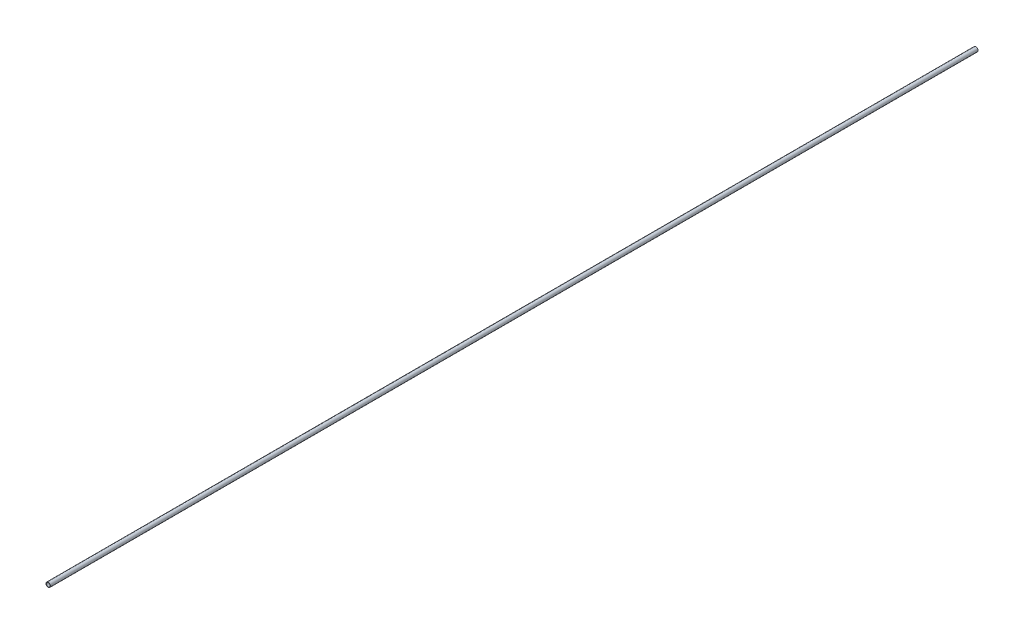
ISO-10303-21;
HEADER;
FILE_DESCRIPTION(('STEP AP214'),'2;1');
FILE_NAME('part.step','',(''),(''),'','','');
FILE_SCHEMA(('AUTOMOTIVE_DESIGN { 1 0 10303 214 1 1 1 1 }'));
ENDSEC;
DATA;
#1=APPLICATION_CONTEXT('core data for automotive mechanical design processes');
#2=APPLICATION_PROTOCOL_DEFINITION('international standard','automotive_design',2000,#1);
#3=PRODUCT_CONTEXT('',#1,'mechanical');
#4=PRODUCT('Part','Part','',(#3));
#5=PRODUCT_RELATED_PRODUCT_CATEGORY('part','',(#4));
#6=PRODUCT_DEFINITION_FORMATION('','',#4);
#7=PRODUCT_DEFINITION_CONTEXT('part definition',#1,'design');
#8=PRODUCT_DEFINITION('design','',#6,#7);
#9=PRODUCT_DEFINITION_SHAPE('','',#8);
#10=(LENGTH_UNIT() NAMED_UNIT(*) SI_UNIT(.MILLI.,.METRE.));
#11=(NAMED_UNIT(*) PLANE_ANGLE_UNIT() SI_UNIT($,.RADIAN.));
#12=(NAMED_UNIT(*) SI_UNIT($,.STERADIAN.) SOLID_ANGLE_UNIT());
#13=UNCERTAINTY_MEASURE_WITH_UNIT(LENGTH_MEASURE(1.E-05),#10,'distance_accuracy_value','');
#14=(GEOMETRIC_REPRESENTATION_CONTEXT(3) GLOBAL_UNCERTAINTY_ASSIGNED_CONTEXT((#13)) GLOBAL_UNIT_ASSIGNED_CONTEXT((#10,
#11,#12)) REPRESENTATION_CONTEXT('',''));
#15=CARTESIAN_POINT('',(0.,0.,0.));
#16=DIRECTION('',(0.,0.,1.));
#17=DIRECTION('',(1.,0.,0.));
#18=AXIS2_PLACEMENT_3D('',#15,#16,#17);
#19=CARTESIAN_POINT('',(0.,0.,523.));
#20=DIRECTION('',(0.,0.,1.));
#21=DIRECTION('',(1.,0.,0.));
#22=AXIS2_PLACEMENT_3D('',#19,#20,#21);
#23=PLANE('',#22);
#24=CARTESIAN_POINT('',(0.,0.,523.));
#25=DIRECTION('',(0.,0.,1.));
#26=DIRECTION('',(1.,0.,0.));
#27=AXIS2_PLACEMENT_3D('',#24,#25,#26);
#28=CIRCLE('',#27,2.5);
#29=CARTESIAN_POINT('',(2.5,0.,523.));
#30=VERTEX_POINT('',#29);
#31=EDGE_CURVE('E11',#30,#30,#28,.T.);
#32=ORIENTED_EDGE('',*,*,#31,.T.);
#33=EDGE_LOOP('',(#32));
#34=FACE_BOUND('',#33,.T.);
#35=CARTESIAN_POINT('',(0.,0.,523.));
#36=DIRECTION('',(0.,0.,1.));
#37=DIRECTION('',(1.,0.,0.));
#38=AXIS2_PLACEMENT_3D('',#35,#36,#37);
#39=CIRCLE('',#38,2.);
#40=CARTESIAN_POINT('',(2.,0.,523.));
#41=VERTEX_POINT('',#40);
#42=EDGE_CURVE('E47',#41,#41,#39,.T.);
#43=ORIENTED_EDGE('',*,*,#42,.F.);
#44=EDGE_LOOP('',(#43));
#45=FACE_BOUND('',#44,.T.);
#46=ADVANCED_FACE('F36',(#34,#45),#23,.T.);
#47=CARTESIAN_POINT('',(0.,0.,-523.));
#48=DIRECTION('',(0.,0.,1.));
#49=DIRECTION('',(1.,0.,0.));
#50=AXIS2_PLACEMENT_3D('',#47,#48,#49);
#51=PLANE('',#50);
#52=CARTESIAN_POINT('',(0.,0.,-523.));
#53=DIRECTION('',(0.,0.,1.));
#54=DIRECTION('',(1.,0.,0.));
#55=AXIS2_PLACEMENT_3D('',#52,#53,#54);
#56=CIRCLE('',#55,2.5);
#57=CARTESIAN_POINT('',(2.5,0.,-523.));
#58=VERTEX_POINT('',#57);
#59=EDGE_CURVE('E40',#58,#58,#56,.T.);
#60=ORIENTED_EDGE('',*,*,#59,.F.);
#61=EDGE_LOOP('',(#60));
#62=FACE_BOUND('',#61,.T.);
#63=CARTESIAN_POINT('',(0.,0.,-523.));
#64=DIRECTION('',(0.,0.,1.));
#65=DIRECTION('',(1.,0.,0.));
#66=AXIS2_PLACEMENT_3D('',#63,#64,#65);
#67=CIRCLE('',#66,2.);
#68=CARTESIAN_POINT('',(2.,0.,-523.));
#69=VERTEX_POINT('',#68);
#70=EDGE_CURVE('E49',#69,#69,#67,.T.);
#71=ORIENTED_EDGE('',*,*,#70,.T.);
#72=EDGE_LOOP('',(#71));
#73=FACE_BOUND('',#72,.T.);
#74=ADVANCED_FACE('F59',(#62,#73),#51,.F.);
#75=CARTESIAN_POINT('',(0.,0.,523.));
#76=DIRECTION('',(0.,0.,-1.));
#77=DIRECTION('',(-1.,0.,0.));
#78=AXIS2_PLACEMENT_3D('',#75,#76,#77);
#79=CYLINDRICAL_SURFACE('',#78,2.5);
#80=ORIENTED_EDGE('',*,*,#31,.F.);
#81=EDGE_LOOP('',(#80));
#82=FACE_BOUND('',#81,.T.);
#83=ORIENTED_EDGE('',*,*,#59,.T.);
#84=EDGE_LOOP('',(#83));
#85=FACE_BOUND('',#84,.T.);
#86=ADVANCED_FACE('F38',(#82,#85),#79,.T.);
#87=CARTESIAN_POINT('',(0.,0.,523.));
#88=DIRECTION('',(0.,0.,-1.));
#89=DIRECTION('',(-1.,0.,0.));
#90=AXIS2_PLACEMENT_3D('',#87,#88,#89);
#91=CYLINDRICAL_SURFACE('',#90,2.);
#92=ORIENTED_EDGE('',*,*,#42,.T.);
#93=EDGE_LOOP('',(#92));
#94=FACE_BOUND('',#93,.T.);
#95=ORIENTED_EDGE('',*,*,#70,.F.);
#96=EDGE_LOOP('',(#95));
#97=FACE_BOUND('',#96,.T.);
#98=ADVANCED_FACE('F55',(#94,#97),#91,.F.);
#99=CLOSED_SHELL('',(#46,#74,#86,#98));
#100=MANIFOLD_SOLID_BREP('B2',#99);
#101=ADVANCED_BREP_SHAPE_REPRESENTATION('',(#18,#100),#14);
#102=SHAPE_DEFINITION_REPRESENTATION(#9,#101);
ENDSEC;
END-ISO-10303-21;
